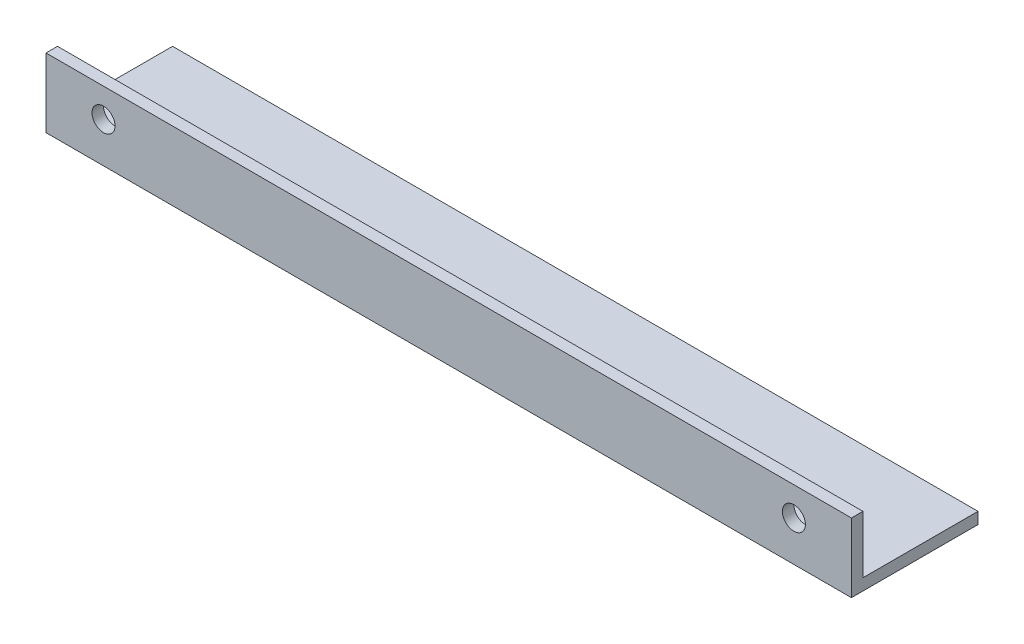
ISO-10303-21;
HEADER;
FILE_DESCRIPTION(('STEP AP214'),'2;1');
FILE_NAME('part.step','',(''),(''),'','','');
FILE_SCHEMA(('AUTOMOTIVE_DESIGN { 1 0 10303 214 1 1 1 1 }'));
ENDSEC;
DATA;
#1=APPLICATION_CONTEXT('core data for automotive mechanical design processes');
#2=APPLICATION_PROTOCOL_DEFINITION('international standard','automotive_design',2000,#1);
#3=PRODUCT_CONTEXT('',#1,'mechanical');
#4=PRODUCT('Part','Part','',(#3));
#5=PRODUCT_RELATED_PRODUCT_CATEGORY('part','',(#4));
#6=PRODUCT_DEFINITION_FORMATION('','',#4);
#7=PRODUCT_DEFINITION_CONTEXT('part definition',#1,'design');
#8=PRODUCT_DEFINITION('design','',#6,#7);
#9=PRODUCT_DEFINITION_SHAPE('','',#8);
#10=(LENGTH_UNIT() NAMED_UNIT(*) SI_UNIT(.MILLI.,.METRE.));
#11=(NAMED_UNIT(*) PLANE_ANGLE_UNIT() SI_UNIT($,.RADIAN.));
#12=(NAMED_UNIT(*) SI_UNIT($,.STERADIAN.) SOLID_ANGLE_UNIT());
#13=UNCERTAINTY_MEASURE_WITH_UNIT(LENGTH_MEASURE(1.E-05),#10,'distance_accuracy_value','');
#14=(GEOMETRIC_REPRESENTATION_CONTEXT(3) GLOBAL_UNCERTAINTY_ASSIGNED_CONTEXT((#13)) GLOBAL_UNIT_ASSIGNED_CONTEXT((#10,
#11,#12)) REPRESENTATION_CONTEXT('',''));
#15=CARTESIAN_POINT('',(0.,0.,0.));
#16=DIRECTION('',(0.,0.,1.));
#17=DIRECTION('',(1.,0.,0.));
#18=AXIS2_PLACEMENT_3D('',#15,#16,#17);
#19=CARTESIAN_POINT('',(0.,0.,2.));
#20=DIRECTION('',(0.,0.,1.));
#21=DIRECTION('',(1.,0.,0.));
#22=AXIS2_PLACEMENT_3D('',#19,#20,#21);
#23=PLANE('',#22);
#24=CARTESIAN_POINT('',(10.,5.,2.));
#25=DIRECTION('',(0.,0.,1.));
#26=DIRECTION('',(1.,0.,0.));
#27=AXIS2_PLACEMENT_3D('',#24,#25,#26);
#28=CIRCLE('',#27,2.);
#29=CARTESIAN_POINT('',(12.,5.,2.));
#30=VERTEX_POINT('',#29);
#31=EDGE_CURVE('E139',#30,#30,#28,.T.);
#32=ORIENTED_EDGE('',*,*,#31,.F.);
#33=EDGE_LOOP('',(#32));
#34=FACE_BOUND('',#33,.T.);
#35=DIRECTION('',(0.,1.,0.));
#36=VECTOR('',#35,1.);
#37=CARTESIAN_POINT('',(140.,0.,2.));
#38=LINE('',#37,#36);
#39=CARTESIAN_POINT('',(140.,10.,2.));
#40=VERTEX_POINT('',#39);
#41=CARTESIAN_POINT('',(140.,-2.,2.));
#42=VERTEX_POINT('',#41);
#43=EDGE_CURVE('E129',#40,#42,#38,.F.);
#44=ORIENTED_EDGE('',*,*,#43,.F.);
#45=DIRECTION('',(1.,0.,0.));
#46=VECTOR('',#45,1.);
#47=CARTESIAN_POINT('',(0.,10.,2.));
#48=LINE('',#47,#46);
#49=CARTESIAN_POINT('',(0.,10.,2.));
#50=VERTEX_POINT('',#49);
#51=EDGE_CURVE('E126',#50,#40,#48,.T.);
#52=ORIENTED_EDGE('',*,*,#51,.F.);
#53=DIRECTION('',(0.,1.,0.));
#54=VECTOR('',#53,1.);
#55=CARTESIAN_POINT('',(0.,0.,2.));
#56=LINE('',#55,#54);
#57=CARTESIAN_POINT('',(0.,-2.,2.));
#58=VERTEX_POINT('',#57);
#59=EDGE_CURVE('E128',#50,#58,#56,.F.);
#60=ORIENTED_EDGE('',*,*,#59,.T.);
#61=DIRECTION('',(1.,0.,0.));
#62=VECTOR('',#61,1.);
#63=CARTESIAN_POINT('',(0.,-2.,2.));
#64=LINE('',#63,#62);
#65=EDGE_CURVE('E123',#58,#42,#64,.T.);
#66=ORIENTED_EDGE('',*,*,#65,.T.);
#67=EDGE_LOOP('',(#44,#52,#60,#66));
#68=FACE_BOUND('',#67,.T.);
#69=CARTESIAN_POINT('',(130.,5.,2.));
#70=DIRECTION('',(0.,0.,-1.));
#71=DIRECTION('',(-1.,0.,0.));
#72=AXIS2_PLACEMENT_3D('',#69,#70,#71);
#73=CIRCLE('',#72,2.);
#74=CARTESIAN_POINT('',(128.,5.,2.));
#75=VERTEX_POINT('',#74);
#76=EDGE_CURVE('E106',#75,#75,#73,.T.);
#77=ORIENTED_EDGE('',*,*,#76,.T.);
#78=EDGE_LOOP('',(#77));
#79=FACE_BOUND('',#78,.T.);
#80=ADVANCED_FACE('F35',(#34,#68,#79),#23,.T.);
#81=CARTESIAN_POINT('',(0.,0.,0.));
#82=DIRECTION('',(0.,0.,1.));
#83=DIRECTION('',(1.,0.,0.));
#84=AXIS2_PLACEMENT_3D('',#81,#82,#83);
#85=PLANE('',#84);
#86=DIRECTION('',(0.,-1.,0.));
#87=VECTOR('',#86,1.);
#88=CARTESIAN_POINT('',(140.,0.,0.));
#89=LINE('',#88,#87);
#90=CARTESIAN_POINT('',(140.,10.,0.));
#91=VERTEX_POINT('',#90);
#92=CARTESIAN_POINT('',(140.,0.,0.));
#93=VERTEX_POINT('',#92);
#94=EDGE_CURVE('E109',#91,#93,#89,.T.);
#95=ORIENTED_EDGE('',*,*,#94,.T.);
#96=DIRECTION('',(1.,0.,0.));
#97=VECTOR('',#96,1.);
#98=CARTESIAN_POINT('',(0.,0.,0.));
#99=LINE('',#98,#97);
#100=CARTESIAN_POINT('',(0.,0.,0.));
#101=VERTEX_POINT('',#100);
#102=EDGE_CURVE('E104',#101,#93,#99,.T.);
#103=ORIENTED_EDGE('',*,*,#102,.F.);
#104=DIRECTION('',(0.,-1.,0.));
#105=VECTOR('',#104,1.);
#106=CARTESIAN_POINT('',(0.,0.,0.));
#107=LINE('',#106,#105);
#108=CARTESIAN_POINT('',(0.,10.,0.));
#109=VERTEX_POINT('',#108);
#110=EDGE_CURVE('E117',#109,#101,#107,.T.);
#111=ORIENTED_EDGE('',*,*,#110,.F.);
#112=DIRECTION('',(1.,0.,0.));
#113=VECTOR('',#112,1.);
#114=CARTESIAN_POINT('',(0.,10.,0.));
#115=LINE('',#114,#113);
#116=EDGE_CURVE('E112',#109,#91,#115,.T.);
#117=ORIENTED_EDGE('',*,*,#116,.T.);
#118=EDGE_LOOP('',(#95,#103,#111,#117));
#119=FACE_BOUND('',#118,.T.);
#120=CARTESIAN_POINT('',(10.,5.,0.));
#121=DIRECTION('',(0.,0.,1.));
#122=DIRECTION('',(1.,0.,0.));
#123=AXIS2_PLACEMENT_3D('',#120,#121,#122);
#124=CIRCLE('',#123,2.);
#125=CARTESIAN_POINT('',(12.,5.,0.));
#126=VERTEX_POINT('',#125);
#127=EDGE_CURVE('E142',#126,#126,#124,.T.);
#128=ORIENTED_EDGE('',*,*,#127,.T.);
#129=EDGE_LOOP('',(#128));
#130=FACE_BOUND('',#129,.T.);
#131=CARTESIAN_POINT('',(130.,5.,0.));
#132=DIRECTION('',(0.,0.,-1.));
#133=DIRECTION('',(-1.,0.,0.));
#134=AXIS2_PLACEMENT_3D('',#131,#132,#133);
#135=CIRCLE('',#134,2.);
#136=CARTESIAN_POINT('',(128.,5.,0.));
#137=VERTEX_POINT('',#136);
#138=EDGE_CURVE('E145',#137,#137,#135,.T.);
#139=ORIENTED_EDGE('',*,*,#138,.F.);
#140=EDGE_LOOP('',(#139));
#141=FACE_BOUND('',#140,.T.);
#142=ADVANCED_FACE('F159',(#119,#130,#141),#85,.F.);
#143=CARTESIAN_POINT('',(0.,0.,0.));
#144=DIRECTION('',(-1.,0.,0.));
#145=DIRECTION('',(0.,0.,-1.));
#146=AXIS2_PLACEMENT_3D('',#143,#144,#145);
#147=PLANE('',#146);
#148=DIRECTION('',(0.,0.,-1.));
#149=VECTOR('',#148,1.);
#150=CARTESIAN_POINT('',(0.,-2.,0.));
#151=LINE('',#150,#149);
#152=CARTESIAN_POINT('',(0.,-2.,-20.));
#153=VERTEX_POINT('',#152);
#154=EDGE_CURVE('E132',#58,#153,#151,.T.);
#155=ORIENTED_EDGE('',*,*,#154,.F.);
#156=ORIENTED_EDGE('',*,*,#59,.F.);
#157=DIRECTION('',(0.,0.,1.));
#158=VECTOR('',#157,1.);
#159=CARTESIAN_POINT('',(0.,10.,0.));
#160=LINE('',#159,#158);
#161=EDGE_CURVE('E11',#109,#50,#160,.T.);
#162=ORIENTED_EDGE('',*,*,#161,.F.);
#163=ORIENTED_EDGE('',*,*,#110,.T.);
#164=DIRECTION('',(0.,0.,-1.));
#165=VECTOR('',#164,1.);
#166=CARTESIAN_POINT('',(0.,0.,0.));
#167=LINE('',#166,#165);
#168=CARTESIAN_POINT('',(0.,0.,-20.));
#169=VERTEX_POINT('',#168);
#170=EDGE_CURVE('E110',#101,#169,#167,.T.);
#171=ORIENTED_EDGE('',*,*,#170,.T.);
#172=DIRECTION('',(0.,-1.,0.));
#173=VECTOR('',#172,1.);
#174=CARTESIAN_POINT('',(0.,0.,-20.));
#175=LINE('',#174,#173);
#176=EDGE_CURVE('E45',#169,#153,#175,.T.);
#177=ORIENTED_EDGE('',*,*,#176,.T.);
#178=EDGE_LOOP('',(#155,#156,#162,#163,#171,#177));
#179=FACE_BOUND('',#178,.T.);
#180=ADVANCED_FACE('F161',(#179),#147,.T.);
#181=CARTESIAN_POINT('',(0.,0.,-20.));
#182=DIRECTION('',(0.,0.,-1.));
#183=DIRECTION('',(1.,0.,0.));
#184=AXIS2_PLACEMENT_3D('',#181,#182,#183);
#185=PLANE('',#184);
#186=ORIENTED_EDGE('',*,*,#176,.F.);
#187=DIRECTION('',(1.,0.,0.));
#188=VECTOR('',#187,1.);
#189=CARTESIAN_POINT('',(0.,0.,-20.));
#190=LINE('',#189,#188);
#191=CARTESIAN_POINT('',(140.,0.,-20.));
#192=VERTEX_POINT('',#191);
#193=EDGE_CURVE('E103',#169,#192,#190,.T.);
#194=ORIENTED_EDGE('',*,*,#193,.T.);
#195=DIRECTION('',(0.,-1.,0.));
#196=VECTOR('',#195,1.);
#197=CARTESIAN_POINT('',(140.,0.,-20.));
#198=LINE('',#197,#196);
#199=CARTESIAN_POINT('',(140.,-2.,-20.));
#200=VERTEX_POINT('',#199);
#201=EDGE_CURVE('E86',#192,#200,#198,.T.);
#202=ORIENTED_EDGE('',*,*,#201,.T.);
#203=DIRECTION('',(1.,0.,0.));
#204=VECTOR('',#203,1.);
#205=CARTESIAN_POINT('',(0.,-2.,-20.));
#206=LINE('',#205,#204);
#207=EDGE_CURVE('E134',#153,#200,#206,.T.);
#208=ORIENTED_EDGE('',*,*,#207,.F.);
#209=EDGE_LOOP('',(#186,#194,#202,#208));
#210=FACE_BOUND('',#209,.T.);
#211=ADVANCED_FACE('F108',(#210),#185,.T.);
#212=CARTESIAN_POINT('',(140.,0.,0.));
#213=DIRECTION('',(-1.,0.,0.));
#214=DIRECTION('',(0.,-1.,0.));
#215=AXIS2_PLACEMENT_3D('',#212,#213,#214);
#216=PLANE('',#215);
#217=ORIENTED_EDGE('',*,*,#43,.T.);
#218=DIRECTION('',(0.,0.,-1.));
#219=VECTOR('',#218,1.);
#220=CARTESIAN_POINT('',(140.,-2.,0.));
#221=LINE('',#220,#219);
#222=EDGE_CURVE('E93',#42,#200,#221,.T.);
#223=ORIENTED_EDGE('',*,*,#222,.T.);
#224=ORIENTED_EDGE('',*,*,#201,.F.);
#225=DIRECTION('',(0.,0.,-1.));
#226=VECTOR('',#225,1.);
#227=CARTESIAN_POINT('',(140.,0.,0.));
#228=LINE('',#227,#226);
#229=EDGE_CURVE('E91',#93,#192,#228,.T.);
#230=ORIENTED_EDGE('',*,*,#229,.F.);
#231=ORIENTED_EDGE('',*,*,#94,.F.);
#232=DIRECTION('',(0.,0.,1.));
#233=VECTOR('',#232,1.);
#234=CARTESIAN_POINT('',(140.,10.,0.));
#235=LINE('',#234,#233);
#236=EDGE_CURVE('E39',#91,#40,#235,.T.);
#237=ORIENTED_EDGE('',*,*,#236,.T.);
#238=EDGE_LOOP('',(#217,#223,#224,#230,#231,#237));
#239=FACE_BOUND('',#238,.T.);
#240=ADVANCED_FACE('F89',(#239),#216,.F.);
#241=CARTESIAN_POINT('',(0.,10.,0.));
#242=DIRECTION('',(0.,-1.,0.));
#243=DIRECTION('',(1.,0.,0.));
#244=AXIS2_PLACEMENT_3D('',#241,#242,#243);
#245=PLANE('',#244);
#246=ORIENTED_EDGE('',*,*,#116,.F.);
#247=ORIENTED_EDGE('',*,*,#161,.T.);
#248=ORIENTED_EDGE('',*,*,#51,.T.);
#249=ORIENTED_EDGE('',*,*,#236,.F.);
#250=EDGE_LOOP('',(#246,#247,#248,#249));
#251=FACE_BOUND('',#250,.T.);
#252=ADVANCED_FACE('F37',(#251),#245,.F.);
#253=CARTESIAN_POINT('',(0.,-2.,0.));
#254=DIRECTION('',(0.,-1.,0.));
#255=DIRECTION('',(0.,0.,-1.));
#256=AXIS2_PLACEMENT_3D('',#253,#254,#255);
#257=PLANE('',#256);
#258=ORIENTED_EDGE('',*,*,#222,.F.);
#259=ORIENTED_EDGE('',*,*,#65,.F.);
#260=ORIENTED_EDGE('',*,*,#154,.T.);
#261=ORIENTED_EDGE('',*,*,#207,.T.);
#262=EDGE_LOOP('',(#258,#259,#260,#261));
#263=FACE_BOUND('',#262,.T.);
#264=ADVANCED_FACE('F190',(#263),#257,.T.);
#265=CARTESIAN_POINT('',(0.,0.,0.));
#266=DIRECTION('',(0.,-1.,0.));
#267=DIRECTION('',(0.,0.,-1.));
#268=AXIS2_PLACEMENT_3D('',#265,#266,#267);
#269=PLANE('',#268);
#270=ORIENTED_EDGE('',*,*,#229,.T.);
#271=ORIENTED_EDGE('',*,*,#193,.F.);
#272=ORIENTED_EDGE('',*,*,#170,.F.);
#273=ORIENTED_EDGE('',*,*,#102,.T.);
#274=EDGE_LOOP('',(#270,#271,#272,#273));
#275=FACE_BOUND('',#274,.T.);
#276=ADVANCED_FACE('F101',(#275),#269,.F.);
#277=CARTESIAN_POINT('',(10.,5.,2.));
#278=DIRECTION('',(0.,0.,-1.));
#279=DIRECTION('',(-1.,0.,0.));
#280=AXIS2_PLACEMENT_3D('',#277,#278,#279);
#281=CYLINDRICAL_SURFACE('',#280,2.);
#282=ORIENTED_EDGE('',*,*,#31,.T.);
#283=EDGE_LOOP('',(#282));
#284=FACE_BOUND('',#283,.T.);
#285=ORIENTED_EDGE('',*,*,#127,.F.);
#286=EDGE_LOOP('',(#285));
#287=FACE_BOUND('',#286,.T.);
#288=ADVANCED_FACE('F155',(#284,#287),#281,.F.);
#289=CARTESIAN_POINT('',(130.,5.,2.));
#290=DIRECTION('',(0.,0.,-1.));
#291=DIRECTION('',(-1.,0.,0.));
#292=AXIS2_PLACEMENT_3D('',#289,#290,#291);
#293=CYLINDRICAL_SURFACE('',#292,2.);
#294=ORIENTED_EDGE('',*,*,#76,.F.);
#295=EDGE_LOOP('',(#294));
#296=FACE_BOUND('',#295,.T.);
#297=ORIENTED_EDGE('',*,*,#138,.T.);
#298=EDGE_LOOP('',(#297));
#299=FACE_BOUND('',#298,.T.);
#300=ADVANCED_FACE('F152',(#296,#299),#293,.F.);
#301=CLOSED_SHELL('',(#80,#142,#180,#211,#240,#252,#264,#276,#288,#300));
#302=MANIFOLD_SOLID_BREP('B2',#301);
#303=ADVANCED_BREP_SHAPE_REPRESENTATION('',(#18,#302),#14);
#304=SHAPE_DEFINITION_REPRESENTATION(#9,#303);
ENDSEC;
END-ISO-10303-21;
